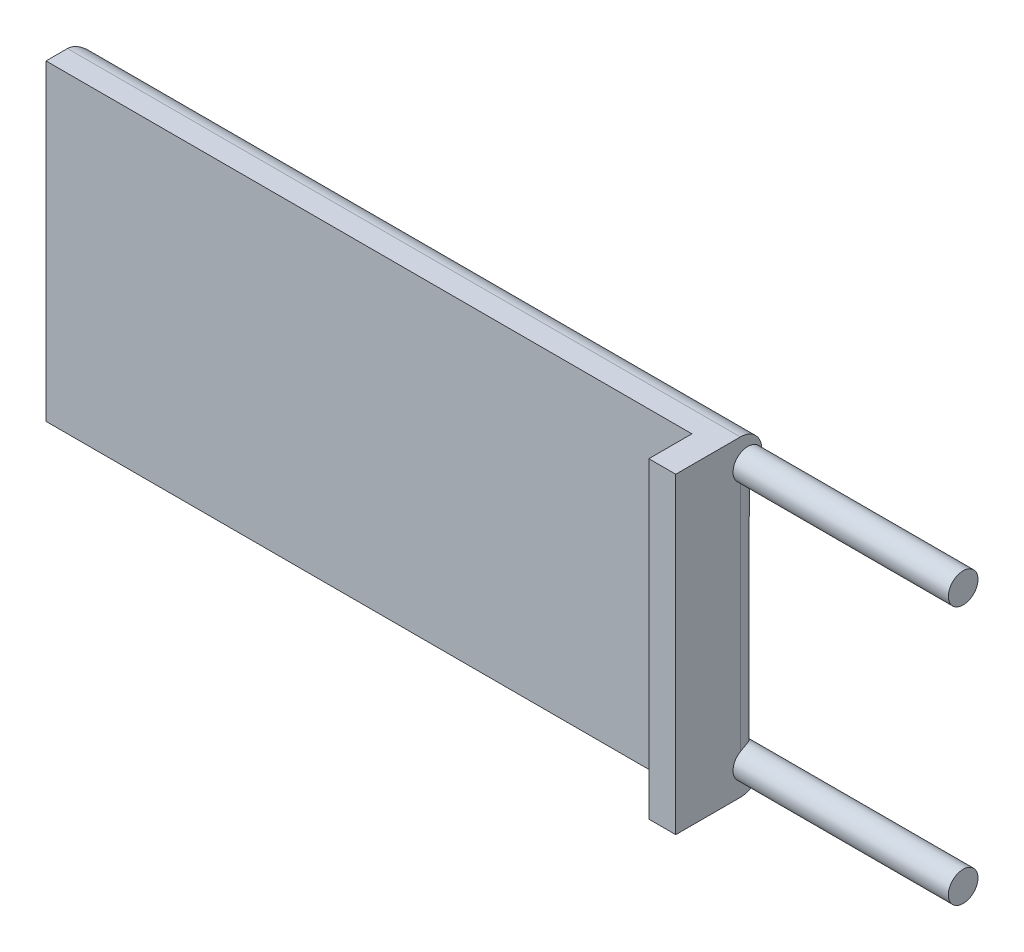
ISO-10303-21;
HEADER;
FILE_DESCRIPTION(('STEP AP214'),'2;1');
FILE_NAME('part.step','',(''),(''),'','','');
FILE_SCHEMA(('AUTOMOTIVE_DESIGN { 1 0 10303 214 1 1 1 1 }'));
ENDSEC;
DATA;
#1=APPLICATION_CONTEXT('core data for automotive mechanical design processes');
#2=APPLICATION_PROTOCOL_DEFINITION('international standard','automotive_design',2000,#1);
#3=PRODUCT_CONTEXT('',#1,'mechanical');
#4=PRODUCT('Part','Part','',(#3));
#5=PRODUCT_RELATED_PRODUCT_CATEGORY('part','',(#4));
#6=PRODUCT_DEFINITION_FORMATION('','',#4);
#7=PRODUCT_DEFINITION_CONTEXT('part definition',#1,'design');
#8=PRODUCT_DEFINITION('design','',#6,#7);
#9=PRODUCT_DEFINITION_SHAPE('','',#8);
#10=(LENGTH_UNIT() NAMED_UNIT(*) SI_UNIT(.MILLI.,.METRE.));
#11=(NAMED_UNIT(*) PLANE_ANGLE_UNIT() SI_UNIT($,.RADIAN.));
#12=(NAMED_UNIT(*) SI_UNIT($,.STERADIAN.) SOLID_ANGLE_UNIT());
#13=UNCERTAINTY_MEASURE_WITH_UNIT(LENGTH_MEASURE(1.E-05),#10,'distance_accuracy_value','');
#14=(GEOMETRIC_REPRESENTATION_CONTEXT(3) GLOBAL_UNCERTAINTY_ASSIGNED_CONTEXT((#13)) GLOBAL_UNIT_ASSIGNED_CONTEXT((#10,
#11,#12)) REPRESENTATION_CONTEXT('',''));
#15=CARTESIAN_POINT('',(0.,0.,0.));
#16=DIRECTION('',(0.,0.,1.));
#17=DIRECTION('',(1.,0.,0.));
#18=AXIS2_PLACEMENT_3D('',#15,#16,#17);
#19=CARTESIAN_POINT('',(-38.1,-18.415,5.08));
#20=DIRECTION('',(1.,0.,0.));
#21=DIRECTION('',(0.,0.,-1.));
#22=AXIS2_PLACEMENT_3D('',#19,#20,#21);
#23=PLANE('',#22);
#24=DIRECTION('',(0.,0.,-1.));
#25=VECTOR('',#24,1.);
#26=CARTESIAN_POINT('',(-38.1,18.415,5.08));
#27=LINE('',#26,#25);
#28=CARTESIAN_POINT('',(-38.1,18.415,5.08));
#29=VERTEX_POINT('',#28);
#30=CARTESIAN_POINT('',(-38.1,18.415,2.54));
#31=VERTEX_POINT('',#30);
#32=EDGE_CURVE('E229',#29,#31,#27,.T.);
#33=ORIENTED_EDGE('',*,*,#32,.T.);
#34=DIRECTION('',(0.,-1.,0.));
#35=VECTOR('',#34,1.);
#36=CARTESIAN_POINT('',(-38.1,-18.415,2.54));
#37=LINE('',#36,#35);
#38=CARTESIAN_POINT('',(-38.1,-18.415,2.54));
#39=VERTEX_POINT('',#38);
#40=EDGE_CURVE('E65',#31,#39,#37,.T.);
#41=ORIENTED_EDGE('',*,*,#40,.T.);
#42=DIRECTION('',(0.,0.,-1.));
#43=VECTOR('',#42,1.);
#44=CARTESIAN_POINT('',(-38.1,-18.415,5.08));
#45=LINE('',#44,#43);
#46=CARTESIAN_POINT('',(-38.1,-18.415,5.08));
#47=VERTEX_POINT('',#46);
#48=EDGE_CURVE('E144',#47,#39,#45,.T.);
#49=ORIENTED_EDGE('',*,*,#48,.F.);
#50=DIRECTION('',(0.,-1.,0.));
#51=VECTOR('',#50,1.);
#52=CARTESIAN_POINT('',(-38.1,-18.415,5.08));
#53=LINE('',#52,#51);
#54=EDGE_CURVE('E214',#29,#47,#53,.T.);
#55=ORIENTED_EDGE('',*,*,#54,.F.);
#56=EDGE_LOOP('',(#33,#41,#49,#55));
#57=FACE_BOUND('',#56,.T.);
#58=ADVANCED_FACE('F38',(#57),#23,.F.);
#59=CARTESIAN_POINT('',(38.1,-18.415,5.08));
#60=DIRECTION('',(0.,1.,0.));
#61=DIRECTION('',(-1.,0.,0.));
#62=AXIS2_PLACEMENT_3D('',#59,#60,#61);
#63=PLANE('',#62);
#64=ORIENTED_EDGE('',*,*,#48,.T.);
#65=DIRECTION('',(1.,0.,0.));
#66=VECTOR('',#65,1.);
#67=CARTESIAN_POINT('',(38.1,-18.415,2.54));
#68=LINE('',#67,#66);
#69=CARTESIAN_POINT('',(41.275,-18.415,2.54));
#70=VERTEX_POINT('',#69);
#71=EDGE_CURVE('E261',#39,#70,#68,.T.);
#72=ORIENTED_EDGE('',*,*,#71,.T.);
#73=DIRECTION('',(0.,0.,-1.));
#74=VECTOR('',#73,1.);
#75=CARTESIAN_POINT('',(41.275,-18.415,10.16));
#76=LINE('',#75,#74);
#77=CARTESIAN_POINT('',(41.275,-18.415,10.16));
#78=VERTEX_POINT('',#77);
#79=EDGE_CURVE('E194',#78,#70,#76,.T.);
#80=ORIENTED_EDGE('',*,*,#79,.F.);
#81=DIRECTION('',(-1.,0.,0.));
#82=VECTOR('',#81,1.);
#83=CARTESIAN_POINT('',(41.275,-18.415,10.16));
#84=LINE('',#83,#82);
#85=CARTESIAN_POINT('',(38.1,-18.415,10.16));
#86=VERTEX_POINT('',#85);
#87=EDGE_CURVE('E197',#78,#86,#84,.T.);
#88=ORIENTED_EDGE('',*,*,#87,.T.);
#89=DIRECTION('',(0.,0.,-1.));
#90=VECTOR('',#89,1.);
#91=CARTESIAN_POINT('',(38.1,-18.415,10.16));
#92=LINE('',#91,#90);
#93=CARTESIAN_POINT('',(38.1,-18.415,5.08));
#94=VERTEX_POINT('',#93);
#95=EDGE_CURVE('E203',#86,#94,#92,.T.);
#96=ORIENTED_EDGE('',*,*,#95,.T.);
#97=DIRECTION('',(1.,0.,0.));
#98=VECTOR('',#97,1.);
#99=CARTESIAN_POINT('',(38.1,-18.415,5.08));
#100=LINE('',#99,#98);
#101=EDGE_CURVE('E218',#47,#94,#100,.T.);
#102=ORIENTED_EDGE('',*,*,#101,.F.);
#103=EDGE_LOOP('',(#64,#72,#80,#88,#96,#102));
#104=FACE_BOUND('',#103,.T.);
#105=ADVANCED_FACE('F305',(#104),#63,.F.);
#106=CARTESIAN_POINT('',(38.1,18.415,5.08));
#107=DIRECTION('',(0.,-1.,0.));
#108=DIRECTION('',(1.,0.,0.));
#109=AXIS2_PLACEMENT_3D('',#106,#107,#108);
#110=PLANE('',#109);
#111=DIRECTION('',(0.,0.,1.));
#112=VECTOR('',#111,1.);
#113=CARTESIAN_POINT('',(41.275,18.415,10.16));
#114=LINE('',#113,#112);
#115=CARTESIAN_POINT('',(41.275,18.415,2.54));
#116=VERTEX_POINT('',#115);
#117=CARTESIAN_POINT('',(41.275,18.415,10.16));
#118=VERTEX_POINT('',#117);
#119=EDGE_CURVE('E157',#116,#118,#114,.T.);
#120=ORIENTED_EDGE('',*,*,#119,.F.);
#121=DIRECTION('',(-1.,0.,0.));
#122=VECTOR('',#121,1.);
#123=CARTESIAN_POINT('',(38.1,18.415,2.54));
#124=LINE('',#123,#122);
#125=EDGE_CURVE('E143',#116,#31,#124,.T.);
#126=ORIENTED_EDGE('',*,*,#125,.T.);
#127=ORIENTED_EDGE('',*,*,#32,.F.);
#128=DIRECTION('',(-1.,0.,0.));
#129=VECTOR('',#128,1.);
#130=CARTESIAN_POINT('',(38.1,18.415,5.08));
#131=LINE('',#130,#129);
#132=CARTESIAN_POINT('',(38.1,18.415,5.08));
#133=VERTEX_POINT('',#132);
#134=EDGE_CURVE('E226',#133,#29,#131,.T.);
#135=ORIENTED_EDGE('',*,*,#134,.F.);
#136=DIRECTION('',(0.,0.,1.));
#137=VECTOR('',#136,1.);
#138=CARTESIAN_POINT('',(38.1,18.415,10.16));
#139=LINE('',#138,#137);
#140=CARTESIAN_POINT('',(38.1,18.415,10.16));
#141=VERTEX_POINT('',#140);
#142=EDGE_CURVE('E184',#133,#141,#139,.T.);
#143=ORIENTED_EDGE('',*,*,#142,.T.);
#144=DIRECTION('',(-1.,0.,0.));
#145=VECTOR('',#144,1.);
#146=CARTESIAN_POINT('',(41.275,18.415,10.16));
#147=LINE('',#146,#145);
#148=EDGE_CURVE('E210',#118,#141,#147,.T.);
#149=ORIENTED_EDGE('',*,*,#148,.F.);
#150=EDGE_LOOP('',(#120,#126,#127,#135,#143,#149));
#151=FACE_BOUND('',#150,.T.);
#152=ADVANCED_FACE('F299',(#151),#110,.F.);
#153=CARTESIAN_POINT('',(0.,0.,5.08));
#154=DIRECTION('',(0.,0.,1.));
#155=DIRECTION('',(1.,0.,0.));
#156=AXIS2_PLACEMENT_3D('',#153,#154,#155);
#157=PLANE('',#156);
#158=ORIENTED_EDGE('',*,*,#54,.T.);
#159=ORIENTED_EDGE('',*,*,#101,.T.);
#160=DIRECTION('',(0.,1.,0.));
#161=VECTOR('',#160,1.);
#162=CARTESIAN_POINT('',(38.1,-18.415,5.08));
#163=LINE('',#162,#161);
#164=EDGE_CURVE('E222',#94,#133,#163,.T.);
#165=ORIENTED_EDGE('',*,*,#164,.T.);
#166=ORIENTED_EDGE('',*,*,#134,.T.);
#167=EDGE_LOOP('',(#158,#159,#165,#166));
#168=FACE_BOUND('',#167,.T.);
#169=ADVANCED_FACE('F296',(#168),#157,.T.);
#170=CARTESIAN_POINT('',(0.,0.,0.));
#171=DIRECTION('',(0.,0.,1.));
#172=DIRECTION('',(1.,0.,0.));
#173=AXIS2_PLACEMENT_3D('',#170,#171,#172);
#174=PLANE('',#173);
#175=DIRECTION('',(0.,1.,0.));
#176=VECTOR('',#175,1.);
#177=CARTESIAN_POINT('',(41.275,-18.415,0.));
#178=LINE('',#177,#176);
#179=CARTESIAN_POINT('',(41.275,14.6697422986293,0.));
#180=VERTEX_POINT('',#179);
#181=CARTESIAN_POINT('',(41.275,15.8302577013707,0.));
#182=VERTEX_POINT('',#181);
#183=EDGE_CURVE('E160',#180,#182,#178,.T.);
#184=ORIENTED_EDGE('',*,*,#183,.F.);
#185=DIRECTION('',(-1.,0.,0.));
#186=VECTOR('',#185,1.);
#187=CARTESIAN_POINT('',(41.275,14.6697422986293,0.));
#188=LINE('',#187,#186);
#189=CARTESIAN_POINT('',(38.735,14.6697422986293,0.));
#190=VERTEX_POINT('',#189);
#191=EDGE_CURVE('E57',#180,#190,#188,.T.);
#192=ORIENTED_EDGE('',*,*,#191,.T.);
#193=DIRECTION('',(0.,1.,0.));
#194=VECTOR('',#193,1.);
#195=CARTESIAN_POINT('',(38.735,0.,0.));
#196=LINE('',#195,#194);
#197=CARTESIAN_POINT('',(38.735,-14.6697422986293,0.));
#198=VERTEX_POINT('',#197);
#199=EDGE_CURVE('E248',#190,#198,#196,.F.);
#200=ORIENTED_EDGE('',*,*,#199,.T.);
#201=DIRECTION('',(-1.,0.,0.));
#202=VECTOR('',#201,1.);
#203=CARTESIAN_POINT('',(38.735,-14.6697422986293,0.));
#204=LINE('',#203,#202);
#205=CARTESIAN_POINT('',(41.275,-14.6697422986293,0.));
#206=VERTEX_POINT('',#205);
#207=EDGE_CURVE('E164',#198,#206,#204,.F.);
#208=ORIENTED_EDGE('',*,*,#207,.T.);
#209=CARTESIAN_POINT('',(41.275,-15.8302577013707,0.));
#210=VERTEX_POINT('',#209);
#211=EDGE_CURVE('E158',#210,#206,#178,.T.);
#212=ORIENTED_EDGE('',*,*,#211,.F.);
#213=CARTESIAN_POINT('',(41.275,-15.875,0.));
#214=VERTEX_POINT('',#213);
#215=EDGE_CURVE('E147',#214,#210,#178,.T.);
#216=ORIENTED_EDGE('',*,*,#215,.F.);
#217=DIRECTION('',(1.,0.,0.));
#218=VECTOR('',#217,1.);
#219=CARTESIAN_POINT('',(0.,-15.875,0.));
#220=LINE('',#219,#218);
#221=CARTESIAN_POINT('',(-35.56,-15.875,0.));
#222=VERTEX_POINT('',#221);
#223=EDGE_CURVE('E240',#214,#222,#220,.F.);
#224=ORIENTED_EDGE('',*,*,#223,.T.);
#225=DIRECTION('',(0.,-1.,0.));
#226=VECTOR('',#225,1.);
#227=CARTESIAN_POINT('',(-35.56,0.,0.));
#228=LINE('',#227,#226);
#229=CARTESIAN_POINT('',(-35.56,15.875,0.));
#230=VERTEX_POINT('',#229);
#231=EDGE_CURVE('E237',#222,#230,#228,.F.);
#232=ORIENTED_EDGE('',*,*,#231,.T.);
#233=DIRECTION('',(-1.,0.,0.));
#234=VECTOR('',#233,1.);
#235=CARTESIAN_POINT('',(0.,15.875,0.));
#236=LINE('',#235,#234);
#237=CARTESIAN_POINT('',(41.275,15.875,0.));
#238=VERTEX_POINT('',#237);
#239=EDGE_CURVE('E243',#230,#238,#236,.F.);
#240=ORIENTED_EDGE('',*,*,#239,.T.);
#241=EDGE_CURVE('E167',#182,#238,#178,.T.);
#242=ORIENTED_EDGE('',*,*,#241,.F.);
#243=EDGE_LOOP('',(#184,#192,#200,#208,#212,#216,#224,#232,#240,#242));
#244=FACE_BOUND('',#243,.T.);
#245=ADVANCED_FACE('F162',(#244),#174,.F.);
#246=CARTESIAN_POINT('',(38.1,0.,0.));
#247=DIRECTION('',(-1.,0.,0.));
#248=DIRECTION('',(0.,0.,1.));
#249=AXIS2_PLACEMENT_3D('',#246,#247,#248);
#250=PLANE('',#249);
#251=ORIENTED_EDGE('',*,*,#164,.F.);
#252=ORIENTED_EDGE('',*,*,#95,.F.);
#253=DIRECTION('',(0.,-1.,0.));
#254=VECTOR('',#253,1.);
#255=CARTESIAN_POINT('',(38.1,-18.415,10.16));
#256=LINE('',#255,#254);
#257=EDGE_CURVE('E200',#141,#86,#256,.T.);
#258=ORIENTED_EDGE('',*,*,#257,.F.);
#259=ORIENTED_EDGE('',*,*,#142,.F.);
#260=EDGE_LOOP('',(#251,#252,#258,#259));
#261=FACE_BOUND('',#260,.T.);
#262=ADVANCED_FACE('F289',(#261),#250,.T.);
#263=CARTESIAN_POINT('',(41.275,-18.415,10.16));
#264=DIRECTION('',(0.,0.,-1.));
#265=DIRECTION('',(-1.,0.,0.));
#266=AXIS2_PLACEMENT_3D('',#263,#264,#265);
#267=PLANE('',#266);
#268=ORIENTED_EDGE('',*,*,#257,.T.);
#269=ORIENTED_EDGE('',*,*,#87,.F.);
#270=DIRECTION('',(0.,-1.,0.));
#271=VECTOR('',#270,1.);
#272=CARTESIAN_POINT('',(41.275,-18.415,10.16));
#273=LINE('',#272,#271);
#274=EDGE_CURVE('E191',#118,#78,#273,.T.);
#275=ORIENTED_EDGE('',*,*,#274,.F.);
#276=ORIENTED_EDGE('',*,*,#148,.T.);
#277=EDGE_LOOP('',(#268,#269,#275,#276));
#278=FACE_BOUND('',#277,.T.);
#279=ADVANCED_FACE('F288',(#278),#267,.F.);
#280=CARTESIAN_POINT('',(41.275,0.,0.));
#281=DIRECTION('',(-1.,0.,0.));
#282=DIRECTION('',(0.,0.,1.));
#283=AXIS2_PLACEMENT_3D('',#280,#281,#282);
#284=PLANE('',#283);
#285=ORIENTED_EDGE('',*,*,#241,.T.);
#286=CARTESIAN_POINT('',(41.275,15.875,2.54));
#287=DIRECTION('',(-1.,0.,0.));
#288=DIRECTION('',(0.,0.,1.));
#289=AXIS2_PLACEMENT_3D('',#286,#287,#288);
#290=CIRCLE('',#289,2.54);
#291=EDGE_CURVE('E258',#238,#116,#290,.F.);
#292=ORIENTED_EDGE('',*,*,#291,.T.);
#293=ORIENTED_EDGE('',*,*,#119,.T.);
#294=ORIENTED_EDGE('',*,*,#274,.T.);
#295=ORIENTED_EDGE('',*,*,#79,.T.);
#296=CARTESIAN_POINT('',(41.275,-15.875,2.54));
#297=DIRECTION('',(-1.,0.,0.));
#298=DIRECTION('',(0.,0.,1.));
#299=AXIS2_PLACEMENT_3D('',#296,#297,#298);
#300=CIRCLE('',#299,2.54);
#301=EDGE_CURVE('E153',#70,#214,#300,.F.);
#302=ORIENTED_EDGE('',*,*,#301,.T.);
#303=ORIENTED_EDGE('',*,*,#215,.T.);
#304=CARTESIAN_POINT('',(41.275,-15.25,1.651));
#305=DIRECTION('',(-1.,0.,0.));
#306=DIRECTION('',(0.,0.,1.));
#307=AXIS2_PLACEMENT_3D('',#304,#305,#306);
#308=CIRCLE('',#307,1.75);
#309=CARTESIAN_POINT('',(41.275,-13.7426251295713,2.54));
#310=VERTEX_POINT('',#309);
#311=EDGE_CURVE('E133',#310,#210,#308,.F.);
#312=ORIENTED_EDGE('',*,*,#311,.F.);
#313=DIRECTION('',(0.,1.,0.));
#314=VECTOR('',#313,1.);
#315=CARTESIAN_POINT('',(41.275,0.,2.54));
#316=LINE('',#315,#314);
#317=CARTESIAN_POINT('',(41.275,13.7426251295713,2.54));
#318=VERTEX_POINT('',#317);
#319=EDGE_CURVE('E253',#310,#318,#316,.T.);
#320=ORIENTED_EDGE('',*,*,#319,.T.);
#321=CARTESIAN_POINT('',(41.275,15.25,1.651));
#322=DIRECTION('',(1.,0.,0.));
#323=DIRECTION('',(0.,0.,-1.));
#324=AXIS2_PLACEMENT_3D('',#321,#322,#323);
#325=CIRCLE('',#324,1.75);
#326=EDGE_CURVE('E185',#182,#318,#325,.T.);
#327=ORIENTED_EDGE('',*,*,#326,.F.);
#328=EDGE_LOOP('',(#285,#292,#293,#294,#295,#302,#303,#312,#320,#327));
#329=FACE_BOUND('',#328,.T.);
#330=ADVANCED_FACE('F150',(#329),#284,.F.);
#331=CARTESIAN_POINT('',(41.275,15.25,1.651));
#332=DIRECTION('',(1.,0.,0.));
#333=DIRECTION('',(0.,0.,-1.));
#334=AXIS2_PLACEMENT_3D('',#331,#332,#333);
#335=PLANE('',#334);
#336=EDGE_CURVE('E175',#180,#182,#325,.T.);
#337=ORIENTED_EDGE('',*,*,#336,.F.);
#338=ORIENTED_EDGE('',*,*,#183,.T.);
#339=EDGE_LOOP('',(#337,#338));
#340=FACE_BOUND('',#339,.T.);
#341=ADVANCED_FACE('F283',(#340),#335,.F.);
#342=CARTESIAN_POINT('',(66.675,15.25,1.651));
#343=DIRECTION('',(-1.,0.,0.));
#344=DIRECTION('',(0.,0.,1.));
#345=AXIS2_PLACEMENT_3D('',#342,#343,#344);
#346=CYLINDRICAL_SURFACE('',#345,1.75);
#347=CARTESIAN_POINT('',(66.675,15.25,1.651));
#348=DIRECTION('',(1.,0.,0.));
#349=DIRECTION('',(0.,0.,-1.));
#350=AXIS2_PLACEMENT_3D('',#347,#348,#349);
#351=CIRCLE('',#350,1.75);
#352=CARTESIAN_POINT('',(66.675,15.25,-0.0990000000000006));
#353=VERTEX_POINT('',#352);
#354=EDGE_CURVE('E180',#353,#353,#351,.T.);
#355=ORIENTED_EDGE('',*,*,#354,.F.);
#356=EDGE_LOOP('',(#355));
#357=FACE_BOUND('',#356,.T.);
#358=ORIENTED_EDGE('',*,*,#326,.T.);
#359=CARTESIAN_POINT('',(41.275,13.7426251295713,2.54));
#360=CARTESIAN_POINT('',(41.2750054203991,13.7211441022873,2.50359029628514));
#361=CARTESIAN_POINT('',(41.2742171688207,13.7009914671123,2.46639139464154));
#362=CARTESIAN_POINT('',(41.270889507819,13.6634514089299,2.39069108553621));
#363=CARTESIAN_POINT('',(41.2683497568691,13.6460645260334,2.35218942544085));
#364=CARTESIAN_POINT('',(41.261363870858,13.6142126140895,2.27427114434971));
#365=CARTESIAN_POINT('',(41.25692250343,13.599740410054,2.23485704319871));
#366=CARTESIAN_POINT('',(41.2460289285573,13.5737324747008,2.15536046758234));
#367=CARTESIAN_POINT('',(41.239576958053,13.5621963976648,2.11527807239891));
#368=CARTESIAN_POINT('',(41.2170519256431,13.5320124644938,1.99436860372894));
#369=CARTESIAN_POINT('',(41.197815649173,13.5178175576281,1.91295004954978));
#370=CARTESIAN_POINT('',(41.1509614177646,13.5009945649105,1.75144607824138));
#371=CARTESIAN_POINT('',(41.1233453576423,13.498363866269,1.67136036404752));
#372=CARTESIAN_POINT('',(41.0603215070476,13.5035633990038,1.51450534229429));
#373=CARTESIAN_POINT('',(41.024896414544,13.5114170584744,1.43774385915168));
#374=CARTESIAN_POINT('',(40.9473030801731,13.5361378244468,1.28925810783703));
#375=CARTESIAN_POINT('',(40.9051292691828,13.5530124022737,1.21753807089498));
#376=CARTESIAN_POINT('',(40.794074421511,13.6038331335594,1.04791088950693));
#377=CARTESIAN_POINT('',(40.7219211477704,13.6420717995889,0.953423412828381));
#378=CARTESIAN_POINT('',(40.5684213311137,13.7299846032573,0.778236153900998));
#379=CARTESIAN_POINT('',(40.4870534814259,13.7796855315546,0.697569457001164));
#380=CARTESIAN_POINT('',(40.2840563223964,13.9077778880429,0.520950492806421));
#381=CARTESIAN_POINT('',(40.1591365467181,13.9897836724945,0.431378833482509));
#382=CARTESIAN_POINT('',(39.9640017279706,14.1172333589927,0.315843373198133));
#383=CARTESIAN_POINT('',(39.8976166476974,14.1604875723992,0.280450971091192));
#384=CARTESIAN_POINT('',(39.7621408337759,14.2472885300679,0.215733786697391));
#385=CARTESIAN_POINT('',(39.6930515086093,14.2908351125128,0.186405894488781));
#386=CARTESIAN_POINT('',(39.549909258605,14.3776941007043,0.133025344231768));
#387=CARTESIAN_POINT('',(39.4757727899817,14.4209686618386,0.109135903714125));
#388=CARTESIAN_POINT('',(39.32320722981,14.503003683863,0.0677821980186268));
#389=CARTESIAN_POINT('',(39.2447811785344,14.5417672825172,0.0503134482178898));
#390=CARTESIAN_POINT('',(39.1087322465984,14.5974443798957,0.0270334580234537));
#391=CARTESIAN_POINT('',(39.0527161798098,14.6173551999971,0.0192779595979511));
#392=CARTESIAN_POINT('',(38.9380803907187,14.6486093596364,0.0074882686840414));
#393=CARTESIAN_POINT('',(38.879477643769,14.6600016945476,0.00343276493480317));
#394=CARTESIAN_POINT('',(38.7919699101194,14.6684010727268,0.000475214976916024));
#395=CARTESIAN_POINT('',(38.7635012714024,14.6698106418197,-1.10026640893841E-05));
#396=CARTESIAN_POINT('',(38.735,14.6697422986293,0.));
#397=B_SPLINE_CURVE_WITH_KNOTS('',3,(#359,#360,#361,#362,#363,#364,#365,#366,#367,#368,#369,
#370,#371,#372,#373,#374,#375,#376,#377,#378,#379,#380,#381,#382,#383,#384,#385,#386,#387,#388,
#389,#390,#391,#392,#393,#394,#395,#396),.UNSPECIFIED.,.F.,.F.,(4,2,2,2,2,2,2,2,2,2,2,2,2,2,2,2,
2,2,4),(0.,0.126793543232293,0.25361181706031,0.380113983621196,0.506601248112549,
0.759802547363518,1.01294663597573,1.26665734219545,1.52057850355241,1.89312872756377,
2.26655869704923,2.78619385186375,3.04636423481929,3.30640086795247,3.57343596870485,
3.84028419894893,4.01966837308989,4.19801268308473,4.28342998330591),.UNSPECIFIED.);
#398=EDGE_CURVE('E49',#318,#190,#397,.T.);
#399=ORIENTED_EDGE('',*,*,#398,.T.);
#400=ORIENTED_EDGE('',*,*,#191,.F.);
#401=ORIENTED_EDGE('',*,*,#336,.T.);
#402=EDGE_LOOP('',(#358,#399,#400,#401));
#403=FACE_BOUND('',#402,.T.);
#404=ADVANCED_FACE('F277',(#357,#403),#346,.T.);
#405=CARTESIAN_POINT('',(66.675,15.25,1.651));
#406=DIRECTION('',(1.,0.,0.));
#407=DIRECTION('',(0.,0.,-1.));
#408=AXIS2_PLACEMENT_3D('',#405,#406,#407);
#409=PLANE('',#408);
#410=ORIENTED_EDGE('',*,*,#354,.T.);
#411=EDGE_LOOP('',(#410));
#412=FACE_BOUND('',#411,.T.);
#413=ADVANCED_FACE('F282',(#412),#409,.T.);
#414=CARTESIAN_POINT('',(41.275,-15.25,1.651));
#415=DIRECTION('',(-1.,0.,0.));
#416=DIRECTION('',(0.,0.,1.));
#417=AXIS2_PLACEMENT_3D('',#414,#415,#416);
#418=PLANE('',#417);
#419=ORIENTED_EDGE('',*,*,#211,.T.);
#420=CARTESIAN_POINT('',(41.275,-15.25,1.651));
#421=DIRECTION('',(1.,0.,0.));
#422=DIRECTION('',(0.,0.,1.));
#423=AXIS2_PLACEMENT_3D('',#420,#421,#422);
#424=CIRCLE('',#423,1.75);
#425=EDGE_CURVE('E137',#210,#206,#424,.T.);
#426=ORIENTED_EDGE('',*,*,#425,.F.);
#427=EDGE_LOOP('',(#419,#426));
#428=FACE_BOUND('',#427,.T.);
#429=ADVANCED_FACE('F168',(#428),#418,.T.);
#430=CARTESIAN_POINT('',(66.675,-15.25,1.651));
#431=DIRECTION('',(-1.,0.,0.));
#432=DIRECTION('',(0.,0.,1.));
#433=AXIS2_PLACEMENT_3D('',#430,#431,#432);
#434=CYLINDRICAL_SURFACE('',#433,1.75);
#435=CARTESIAN_POINT('',(66.675,-15.25,1.651));
#436=DIRECTION('',(1.,0.,0.));
#437=DIRECTION('',(0.,0.,1.));
#438=AXIS2_PLACEMENT_3D('',#435,#436,#437);
#439=CIRCLE('',#438,1.75);
#440=CARTESIAN_POINT('',(66.675,-15.25,3.401));
#441=VERTEX_POINT('',#440);
#442=EDGE_CURVE('E170',#441,#441,#439,.T.);
#443=ORIENTED_EDGE('',*,*,#442,.F.);
#444=EDGE_LOOP('',(#443));
#445=FACE_BOUND('',#444,.T.);
#446=ORIENTED_EDGE('',*,*,#425,.T.);
#447=ORIENTED_EDGE('',*,*,#207,.F.);
#448=CARTESIAN_POINT('',(38.735,-14.6697422986293,0.));
#449=CARTESIAN_POINT('',(38.7671557187754,-14.6697920637455,-6.94456944066048E-06));
#450=CARTESIAN_POINT('',(38.7992638864133,-14.6680049260364,0.000610408799026902));
#451=CARTESIAN_POINT('',(38.862957371425,-14.6611799365912,0.00302759808090581));
#452=CARTESIAN_POINT('',(38.8945443225282,-14.656155822981,0.00482243718380323));
#453=CARTESIAN_POINT('',(38.9870986243945,-14.637078553156,0.0117930075967998));
#454=CARTESIAN_POINT('',(39.0471052913816,-14.6189888452519,0.0185601509284915));
#455=CARTESIAN_POINT('',(39.157526088604,-14.5784850379549,0.0348351485515722));
#456=CARTESIAN_POINT('',(39.20827233104,-14.5567584862038,0.0439632198573539));
#457=CARTESIAN_POINT('',(39.307735864361,-14.5101207452785,0.0648933655793018));
#458=CARTESIAN_POINT('',(39.3564515602228,-14.4852071128627,0.07669749690217));
#459=CARTESIAN_POINT('',(39.4528248221953,-14.4332206102298,0.103022997181998));
#460=CARTESIAN_POINT('',(39.5004595904227,-14.4061233609349,0.117578526926104));
#461=CARTESIAN_POINT('',(39.5942969410535,-14.3509572999845,0.149255548623897));
#462=CARTESIAN_POINT('',(39.6404991995253,-14.3228882715758,0.16637761591123));
#463=CARTESIAN_POINT('',(39.7592948807492,-14.2492723751662,0.214347095777882));
#464=CARTESIAN_POINT('',(39.8309065086926,-14.2034462008247,0.247222398343826));
#465=CARTESIAN_POINT('',(39.9712318019703,-14.1126225522152,0.319737507097693));
#466=CARTESIAN_POINT('',(40.0399438804663,-14.0676255391201,0.35938095892096));
#467=CARTESIAN_POINT('',(40.1739402989982,-13.9800498457551,0.445399765699587));
#468=CARTESIAN_POINT('',(40.2392422702159,-13.9374586083219,0.49173457301025));
#469=CARTESIAN_POINT('',(40.3664003758592,-13.8556845993478,0.591498583503452));
#470=CARTESIAN_POINT('',(40.4282589705586,-13.816499382685,0.644922626659258));
#471=CARTESIAN_POINT('',(40.5629617147438,-13.7335726924774,0.773406563863131));
#472=CARTESIAN_POINT('',(40.6346788820771,-13.6911466646824,0.850534578239718));
#473=CARTESIAN_POINT('',(40.7699681184801,-13.6166648170839,1.01621892866615));
#474=CARTESIAN_POINT('',(40.8335455044853,-13.5846022067709,1.10476772793921));
#475=CARTESIAN_POINT('',(40.9399705865724,-13.5388030392016,1.27587672216043));
#476=CARTESIAN_POINT('',(40.984499555181,-13.5228443588491,1.35678370433949));
#477=CARTESIAN_POINT('',(41.0648769571376,-13.5025710601279,1.52419132909329));
#478=CARTESIAN_POINT('',(41.1007336383087,-13.4982453382296,1.61068655692058));
#479=CARTESIAN_POINT('',(41.1627689032902,-13.5030746287229,1.78742947108801));
#480=CARTESIAN_POINT('',(41.1888816547149,-13.5123193291271,1.87769825736948));
#481=CARTESIAN_POINT('',(41.2305642565977,-13.545529649353,2.05801804651757));
#482=CARTESIAN_POINT('',(41.2461363278132,-13.569492166329,2.14806909127271));
#483=CARTESIAN_POINT('',(41.2630931952182,-13.6193466364174,2.28865398998402));
#484=CARTESIAN_POINT('',(41.2676646542336,-13.6405919497339,2.34052336725996));
#485=CARTESIAN_POINT('',(41.2736209022393,-13.6879882779076,2.44204970113928));
#486=CARTESIAN_POINT('',(41.2750114393059,-13.7141303514187,2.49171048921643));
#487=CARTESIAN_POINT('',(41.275,-13.7426251295713,2.54));
#488=B_SPLINE_CURVE_WITH_KNOTS('',3,(#448,#449,#450,#451,#452,#453,#454,#455,#456,#457,#458,
#459,#460,#461,#462,#463,#464,#465,#466,#467,#468,#469,#470,#471,#472,#473,#474,#475,#476,#477,
#478,#479,#480,#481,#482,#483,#484,#485,#486,#487),.UNSPECIFIED.,.F.,.F.,(4,2,2,2,2,2,2,2,2,2,2,
2,2,2,2,2,2,2,2,4),(0.,0.0963332960868709,0.192260411183772,0.380447019331894,0.548092500771411,
0.715867279508404,0.885881113042647,1.05593311526246,1.32908088506258,1.60237625166794,
1.87408008375479,2.14558722516274,2.48506917860343,2.82432823734831,3.1043608460819,
3.38412607177746,3.66574863309425,3.94731184243299,4.11570566774001,4.28379495624759),.UNSPECIFIED.);
#489=EDGE_CURVE('E11',#198,#310,#488,.T.);
#490=ORIENTED_EDGE('',*,*,#489,.T.);
#491=ORIENTED_EDGE('',*,*,#311,.T.);
#492=EDGE_LOOP('',(#446,#447,#490,#491));
#493=FACE_BOUND('',#492,.T.);
#494=ADVANCED_FACE('F135',(#445,#493),#434,.T.);
#495=CARTESIAN_POINT('',(66.675,-15.25,1.651));
#496=DIRECTION('',(-1.,0.,0.));
#497=DIRECTION('',(0.,0.,1.));
#498=AXIS2_PLACEMENT_3D('',#495,#496,#497);
#499=PLANE('',#498);
#500=ORIENTED_EDGE('',*,*,#442,.T.);
#501=EDGE_LOOP('',(#500));
#502=FACE_BOUND('',#501,.T.);
#503=ADVANCED_FACE('F321',(#502),#499,.F.);
#504=CARTESIAN_POINT('',(38.1,-15.875,2.54));
#505=DIRECTION('',(1.,0.,0.));
#506=DIRECTION('',(0.,1.,0.));
#507=AXIS2_PLACEMENT_3D('',#504,#505,#506);
#508=CYLINDRICAL_SURFACE('',#507,2.54);
#509=ORIENTED_EDGE('',*,*,#301,.F.);
#510=ORIENTED_EDGE('',*,*,#71,.F.);
#511=CARTESIAN_POINT('',(-35.56,-15.875,2.54));
#512=DIRECTION('',(0.707106781186548,-0.707106781186547,0.));
#513=DIRECTION('',(-0.707106781186547,-0.707106781186547,0.));
#514=AXIS2_PLACEMENT_3D('',#511,#512,#513);
#515=ELLIPSE('',#514,3.59210244842766,2.54);
#516=EDGE_CURVE('E43',#222,#39,#515,.F.);
#517=ORIENTED_EDGE('',*,*,#516,.F.);
#518=ORIENTED_EDGE('',*,*,#223,.F.);
#519=EDGE_LOOP('',(#509,#510,#517,#518));
#520=FACE_BOUND('',#519,.T.);
#521=ADVANCED_FACE('F318',(#520),#508,.T.);
#522=CARTESIAN_POINT('',(-35.56,-18.415,2.54));
#523=DIRECTION('',(0.,-1.,0.));
#524=DIRECTION('',(0.,0.,-1.));
#525=AXIS2_PLACEMENT_3D('',#522,#523,#524);
#526=CYLINDRICAL_SURFACE('',#525,2.54);
#527=ORIENTED_EDGE('',*,*,#516,.T.);
#528=ORIENTED_EDGE('',*,*,#40,.F.);
#529=CARTESIAN_POINT('',(-35.56,15.875,2.54));
#530=DIRECTION('',(-0.707106781186547,-0.707106781186547,0.));
#531=DIRECTION('',(0.707106781186548,-0.707106781186547,0.));
#532=AXIS2_PLACEMENT_3D('',#529,#530,#531);
#533=ELLIPSE('',#532,3.59210244842766,2.54);
#534=EDGE_CURVE('E178',#230,#31,#533,.F.);
#535=ORIENTED_EDGE('',*,*,#534,.F.);
#536=ORIENTED_EDGE('',*,*,#231,.F.);
#537=EDGE_LOOP('',(#527,#528,#535,#536));
#538=FACE_BOUND('',#537,.T.);
#539=ADVANCED_FACE('F315',(#538),#526,.T.);
#540=CARTESIAN_POINT('',(38.1,15.875,2.54));
#541=DIRECTION('',(-1.,0.,0.));
#542=DIRECTION('',(0.,-1.,0.));
#543=AXIS2_PLACEMENT_3D('',#540,#541,#542);
#544=CYLINDRICAL_SURFACE('',#543,2.54);
#545=ORIENTED_EDGE('',*,*,#291,.F.);
#546=ORIENTED_EDGE('',*,*,#239,.F.);
#547=ORIENTED_EDGE('',*,*,#534,.T.);
#548=ORIENTED_EDGE('',*,*,#125,.F.);
#549=EDGE_LOOP('',(#545,#546,#547,#548));
#550=FACE_BOUND('',#549,.T.);
#551=ADVANCED_FACE('F312',(#550),#544,.T.);
#552=CARTESIAN_POINT('',(38.735,0.,2.54));
#553=DIRECTION('',(0.,1.,0.));
#554=DIRECTION('',(0.,0.,1.));
#555=AXIS2_PLACEMENT_3D('',#552,#553,#554);
#556=CYLINDRICAL_SURFACE('',#555,2.54);
#557=ORIENTED_EDGE('',*,*,#489,.F.);
#558=ORIENTED_EDGE('',*,*,#199,.F.);
#559=ORIENTED_EDGE('',*,*,#398,.F.);
#560=ORIENTED_EDGE('',*,*,#319,.F.);
#561=EDGE_LOOP('',(#557,#558,#559,#560));
#562=FACE_BOUND('',#561,.T.);
#563=ADVANCED_FACE('F40',(#562),#556,.T.);
#564=CLOSED_SHELL('',(#58,#105,#152,#169,#245,#262,#279,#330,#341,#404,#413,#429,#494,#503,#521,
#539,#551,#563));
#565=MANIFOLD_SOLID_BREP('B2',#564);
#566=ADVANCED_BREP_SHAPE_REPRESENTATION('',(#18,#565),#14);
#567=SHAPE_DEFINITION_REPRESENTATION(#9,#566);
ENDSEC;
END-ISO-10303-21;
